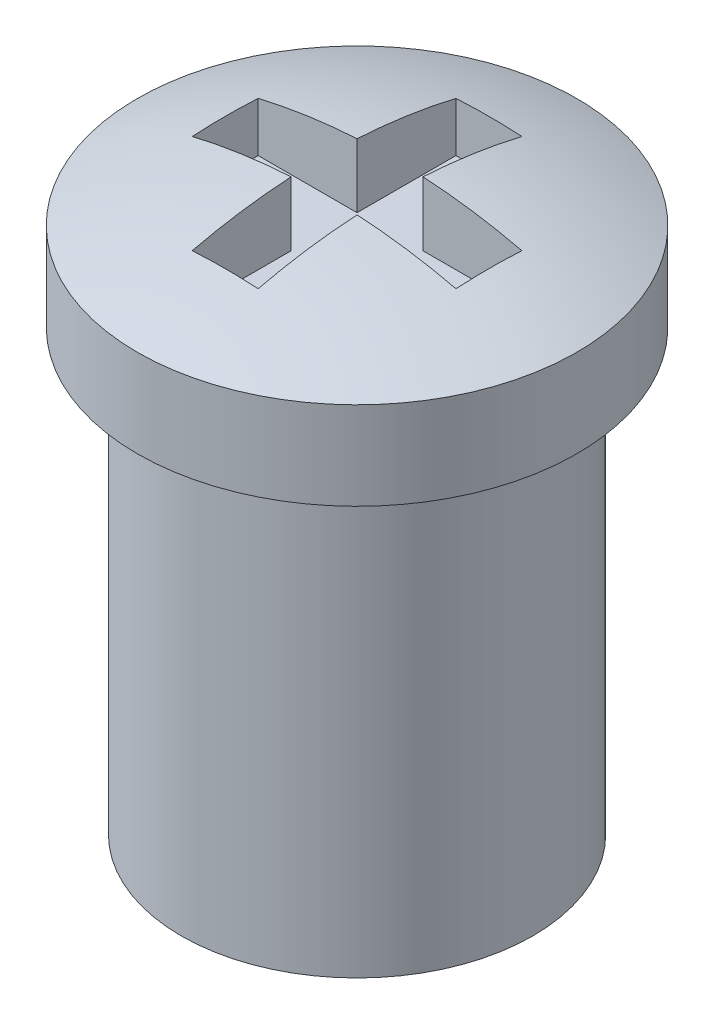
ISO-10303-21;
HEADER;
FILE_DESCRIPTION(('STEP AP214'),'2;1');
FILE_NAME('part.step','',(''),(''),'','','');
FILE_SCHEMA(('AUTOMOTIVE_DESIGN { 1 0 10303 214 1 1 1 1 }'));
ENDSEC;
DATA;
#1=APPLICATION_CONTEXT('core data for automotive mechanical design processes');
#2=APPLICATION_PROTOCOL_DEFINITION('international standard','automotive_design',2000,#1);
#3=PRODUCT_CONTEXT('',#1,'mechanical');
#4=PRODUCT('Part','Part','',(#3));
#5=PRODUCT_RELATED_PRODUCT_CATEGORY('part','',(#4));
#6=PRODUCT_DEFINITION_FORMATION('','',#4);
#7=PRODUCT_DEFINITION_CONTEXT('part definition',#1,'design');
#8=PRODUCT_DEFINITION('design','',#6,#7);
#9=PRODUCT_DEFINITION_SHAPE('','',#8);
#10=(LENGTH_UNIT() NAMED_UNIT(*) SI_UNIT(.MILLI.,.METRE.));
#11=(NAMED_UNIT(*) PLANE_ANGLE_UNIT() SI_UNIT($,.RADIAN.));
#12=(NAMED_UNIT(*) SI_UNIT($,.STERADIAN.) SOLID_ANGLE_UNIT());
#13=UNCERTAINTY_MEASURE_WITH_UNIT(LENGTH_MEASURE(1.E-05),#10,'distance_accuracy_value','');
#14=(GEOMETRIC_REPRESENTATION_CONTEXT(3) GLOBAL_UNCERTAINTY_ASSIGNED_CONTEXT((#13)) GLOBAL_UNIT_ASSIGNED_CONTEXT((#10,
#11,#12)) REPRESENTATION_CONTEXT('',''));
#15=CARTESIAN_POINT('',(0.,0.,0.));
#16=DIRECTION('',(0.,0.,1.));
#17=DIRECTION('',(1.,0.,0.));
#18=AXIS2_PLACEMENT_3D('',#15,#16,#17);
#19=CARTESIAN_POINT('',(0.,5.,0.));
#20=DIRECTION('',(0.,-1.,0.));
#21=DIRECTION('',(0.,0.,-1.));
#22=AXIS2_PLACEMENT_3D('',#19,#20,#21);
#23=CYLINDRICAL_SURFACE('',#22,2.);
#24=CARTESIAN_POINT('',(0.,5.,0.));
#25=DIRECTION('',(0.,1.,0.));
#26=DIRECTION('',(0.,0.,1.));
#27=AXIS2_PLACEMENT_3D('',#24,#25,#26);
#28=CIRCLE('',#27,2.);
#29=CARTESIAN_POINT('',(0.,5.,2.));
#30=VERTEX_POINT('',#29);
#31=EDGE_CURVE('E197',#30,#30,#28,.T.);
#32=ORIENTED_EDGE('',*,*,#31,.F.);
#33=EDGE_LOOP('',(#32));
#34=FACE_BOUND('',#33,.T.);
#35=CARTESIAN_POINT('',(0.,0.,0.));
#36=DIRECTION('',(0.,1.,0.));
#37=DIRECTION('',(0.,0.,1.));
#38=AXIS2_PLACEMENT_3D('',#35,#36,#37);
#39=CIRCLE('',#38,2.);
#40=CARTESIAN_POINT('',(0.,0.,2.));
#41=VERTEX_POINT('',#40);
#42=EDGE_CURVE('E201',#41,#41,#39,.T.);
#43=ORIENTED_EDGE('',*,*,#42,.T.);
#44=EDGE_LOOP('',(#43));
#45=FACE_BOUND('',#44,.T.);
#46=ADVANCED_FACE('F34',(#34,#45),#23,.T.);
#47=CARTESIAN_POINT('',(0.,0.,0.));
#48=DIRECTION('',(0.,1.,0.));
#49=DIRECTION('',(0.,0.,1.));
#50=AXIS2_PLACEMENT_3D('',#47,#48,#49);
#51=PLANE('',#50);
#52=ORIENTED_EDGE('',*,*,#42,.F.);
#53=EDGE_LOOP('',(#52));
#54=FACE_BOUND('',#53,.T.);
#55=ADVANCED_FACE('F275',(#54),#51,.F.);
#56=CARTESIAN_POINT('',(0.,6.,0.));
#57=DIRECTION('',(0.,-1.,0.));
#58=DIRECTION('',(0.,0.,-1.));
#59=AXIS2_PLACEMENT_3D('',#56,#57,#58);
#60=CYLINDRICAL_SURFACE('',#59,2.5);
#61=CARTESIAN_POINT('',(0.,6.,0.));
#62=DIRECTION('',(0.,1.,0.));
#63=DIRECTION('',(0.,0.,1.));
#64=AXIS2_PLACEMENT_3D('',#61,#62,#63);
#65=CIRCLE('',#64,2.5);
#66=CARTESIAN_POINT('',(0.,6.,2.5));
#67=VERTEX_POINT('',#66);
#68=EDGE_CURVE('E196',#67,#67,#65,.T.);
#69=ORIENTED_EDGE('',*,*,#68,.F.);
#70=EDGE_LOOP('',(#69));
#71=FACE_BOUND('',#70,.T.);
#72=CARTESIAN_POINT('',(0.,5.,0.));
#73=DIRECTION('',(0.,1.,0.));
#74=DIRECTION('',(0.,0.,1.));
#75=AXIS2_PLACEMENT_3D('',#72,#73,#74);
#76=CIRCLE('',#75,2.5);
#77=CARTESIAN_POINT('',(0.,5.,2.5));
#78=VERTEX_POINT('',#77);
#79=EDGE_CURVE('E166',#78,#78,#76,.T.);
#80=ORIENTED_EDGE('',*,*,#79,.T.);
#81=EDGE_LOOP('',(#80));
#82=FACE_BOUND('',#81,.T.);
#83=ADVANCED_FACE('F280',(#71,#82),#60,.T.);
#84=CARTESIAN_POINT('',(0.,0.,0.));
#85=DIRECTION('',(0.,0.,1.));
#86=DIRECTION('',(1.,0.,0.));
#87=AXIS2_PLACEMENT_3D('',#84,#85,#86);
#88=SPHERICAL_SURFACE('',#87,6.49999999999999);
#89=CARTESIAN_POINT('',(0.,0.,0.375));
#90=DIRECTION('',(0.,0.,1.));
#91=DIRECTION('',(1.,0.,0.));
#92=AXIS2_PLACEMENT_3D('',#89,#90,#91);
#93=CIRCLE('',#92,6.4891736762087);
#94=CARTESIAN_POINT('',(-1.5,6.3134281495872,0.375));
#95=VERTEX_POINT('',#94);
#96=CARTESIAN_POINT('',(-0.375,6.47832925992497,0.375));
#97=VERTEX_POINT('',#96);
#98=EDGE_CURVE('E11',#95,#97,#93,.F.);
#99=ORIENTED_EDGE('',*,*,#98,.F.);
#100=CARTESIAN_POINT('',(-1.5,0.,0.));
#101=DIRECTION('',(-1.,0.,0.));
#102=DIRECTION('',(0.,0.,1.));
#103=AXIS2_PLACEMENT_3D('',#100,#101,#102);
#104=CIRCLE('',#103,6.32455532033675);
#105=CARTESIAN_POINT('',(-1.5,6.3134281495872,-0.375));
#106=VERTEX_POINT('',#105);
#107=EDGE_CURVE('E42',#106,#95,#104,.F.);
#108=ORIENTED_EDGE('',*,*,#107,.F.);
#109=CARTESIAN_POINT('',(0.,0.,-0.375));
#110=DIRECTION('',(0.,0.,1.));
#111=DIRECTION('',(1.,0.,0.));
#112=AXIS2_PLACEMENT_3D('',#109,#110,#111);
#113=CIRCLE('',#112,6.4891736762087);
#114=CARTESIAN_POINT('',(-0.375,6.47832925992497,-0.375));
#115=VERTEX_POINT('',#114);
#116=EDGE_CURVE('E228',#106,#115,#113,.F.);
#117=ORIENTED_EDGE('',*,*,#116,.T.);
#118=CARTESIAN_POINT('',(-0.375,0.,0.));
#119=DIRECTION('',(-1.,0.,0.));
#120=DIRECTION('',(0.,0.,1.));
#121=AXIS2_PLACEMENT_3D('',#118,#119,#120);
#122=CIRCLE('',#121,6.4891736762087);
#123=CARTESIAN_POINT('',(-0.375,6.3134281495872,-1.5));
#124=VERTEX_POINT('',#123);
#125=EDGE_CURVE('E226',#124,#115,#122,.F.);
#126=ORIENTED_EDGE('',*,*,#125,.F.);
#127=CARTESIAN_POINT('',(0.,0.,-1.5));
#128=DIRECTION('',(0.,0.,1.));
#129=DIRECTION('',(1.,0.,0.));
#130=AXIS2_PLACEMENT_3D('',#127,#128,#129);
#131=CIRCLE('',#130,6.32455532033675);
#132=CARTESIAN_POINT('',(0.375,6.3134281495872,-1.5));
#133=VERTEX_POINT('',#132);
#134=EDGE_CURVE('E223',#124,#133,#131,.F.);
#135=ORIENTED_EDGE('',*,*,#134,.T.);
#136=CARTESIAN_POINT('',(0.375,0.,0.));
#137=DIRECTION('',(-1.,0.,0.));
#138=DIRECTION('',(0.,0.,1.));
#139=AXIS2_PLACEMENT_3D('',#136,#137,#138);
#140=CIRCLE('',#139,6.4891736762087);
#141=CARTESIAN_POINT('',(0.375,6.47832925992497,-0.375));
#142=VERTEX_POINT('',#141);
#143=EDGE_CURVE('E220',#133,#142,#140,.F.);
#144=ORIENTED_EDGE('',*,*,#143,.T.);
#145=CARTESIAN_POINT('',(0.,0.,-0.375));
#146=DIRECTION('',(0.,0.,1.));
#147=DIRECTION('',(1.,0.,0.));
#148=AXIS2_PLACEMENT_3D('',#145,#146,#147);
#149=CIRCLE('',#148,6.4891736762087);
#150=CARTESIAN_POINT('',(1.5,6.3134281495872,-0.375));
#151=VERTEX_POINT('',#150);
#152=EDGE_CURVE('E217',#142,#151,#149,.F.);
#153=ORIENTED_EDGE('',*,*,#152,.T.);
#154=CARTESIAN_POINT('',(1.5,0.,0.));
#155=DIRECTION('',(-1.,0.,0.));
#156=DIRECTION('',(0.,0.,1.));
#157=AXIS2_PLACEMENT_3D('',#154,#155,#156);
#158=CIRCLE('',#157,6.32455532033675);
#159=CARTESIAN_POINT('',(1.5,6.3134281495872,0.375));
#160=VERTEX_POINT('',#159);
#161=EDGE_CURVE('E214',#151,#160,#158,.F.);
#162=ORIENTED_EDGE('',*,*,#161,.T.);
#163=CARTESIAN_POINT('',(0.,0.,0.375));
#164=DIRECTION('',(0.,0.,1.));
#165=DIRECTION('',(1.,0.,0.));
#166=AXIS2_PLACEMENT_3D('',#163,#164,#165);
#167=CIRCLE('',#166,6.4891736762087);
#168=CARTESIAN_POINT('',(0.375,6.47832925992497,0.375));
#169=VERTEX_POINT('',#168);
#170=EDGE_CURVE('E212',#169,#160,#167,.F.);
#171=ORIENTED_EDGE('',*,*,#170,.F.);
#172=CARTESIAN_POINT('',(0.375,0.,0.));
#173=DIRECTION('',(-1.,0.,0.));
#174=DIRECTION('',(0.,0.,1.));
#175=AXIS2_PLACEMENT_3D('',#172,#173,#174);
#176=CIRCLE('',#175,6.4891736762087);
#177=CARTESIAN_POINT('',(0.375,6.3134281495872,1.5));
#178=VERTEX_POINT('',#177);
#179=EDGE_CURVE('E209',#169,#178,#176,.F.);
#180=ORIENTED_EDGE('',*,*,#179,.T.);
#181=CARTESIAN_POINT('',(0.,0.,1.5));
#182=DIRECTION('',(0.,0.,1.));
#183=DIRECTION('',(1.,0.,0.));
#184=AXIS2_PLACEMENT_3D('',#181,#182,#183);
#185=CIRCLE('',#184,6.32455532033675);
#186=CARTESIAN_POINT('',(-0.375,6.3134281495872,1.5));
#187=VERTEX_POINT('',#186);
#188=EDGE_CURVE('E207',#187,#178,#185,.F.);
#189=ORIENTED_EDGE('',*,*,#188,.F.);
#190=CARTESIAN_POINT('',(-0.375,0.,0.));
#191=DIRECTION('',(-1.,0.,0.));
#192=DIRECTION('',(0.,0.,1.));
#193=AXIS2_PLACEMENT_3D('',#190,#191,#192);
#194=CIRCLE('',#193,6.4891736762087);
#195=EDGE_CURVE('E200',#97,#187,#194,.F.);
#196=ORIENTED_EDGE('',*,*,#195,.F.);
#197=EDGE_LOOP('',(#99,#108,#117,#126,#135,#144,#153,#162,#171,#180,#189,#196));
#198=FACE_BOUND('',#197,.T.);
#199=ORIENTED_EDGE('',*,*,#68,.T.);
#200=EDGE_LOOP('',(#199));
#201=FACE_BOUND('',#200,.T.);
#202=ADVANCED_FACE('F36',(#198,#201),#88,.T.);
#203=CARTESIAN_POINT('',(0.,5.,0.));
#204=DIRECTION('',(0.,1.,0.));
#205=DIRECTION('',(0.,0.,1.));
#206=AXIS2_PLACEMENT_3D('',#203,#204,#205);
#207=PLANE('',#206);
#208=ORIENTED_EDGE('',*,*,#31,.T.);
#209=EDGE_LOOP('',(#208));
#210=FACE_BOUND('',#209,.T.);
#211=ORIENTED_EDGE('',*,*,#79,.F.);
#212=EDGE_LOOP('',(#211));
#213=FACE_BOUND('',#212,.T.);
#214=ADVANCED_FACE('F289',(#210,#213),#207,.F.);
#215=CARTESIAN_POINT('',(0.,5.75,0.375));
#216=DIRECTION('',(0.,0.,1.));
#217=DIRECTION('',(1.,0.,0.));
#218=AXIS2_PLACEMENT_3D('',#215,#216,#217);
#219=PLANE('',#218);
#220=ORIENTED_EDGE('',*,*,#98,.T.);
#221=DIRECTION('',(0.,1.,0.));
#222=VECTOR('',#221,1.);
#223=CARTESIAN_POINT('',(-0.375,5.75,0.375));
#224=LINE('',#223,#222);
#225=CARTESIAN_POINT('',(-0.375,5.75,0.375));
#226=VERTEX_POINT('',#225);
#227=EDGE_CURVE('E49',#226,#97,#224,.T.);
#228=ORIENTED_EDGE('',*,*,#227,.F.);
#229=DIRECTION('',(1.,0.,0.));
#230=VECTOR('',#229,1.);
#231=CARTESIAN_POINT('',(0.,5.75,0.375));
#232=LINE('',#231,#230);
#233=CARTESIAN_POINT('',(-1.5,5.75,0.375));
#234=VERTEX_POINT('',#233);
#235=EDGE_CURVE('E123',#234,#226,#232,.T.);
#236=ORIENTED_EDGE('',*,*,#235,.F.);
#237=DIRECTION('',(0.,1.,0.));
#238=VECTOR('',#237,1.);
#239=CARTESIAN_POINT('',(-1.5,5.75,0.375));
#240=LINE('',#239,#238);
#241=EDGE_CURVE('E164',#234,#95,#240,.T.);
#242=ORIENTED_EDGE('',*,*,#241,.T.);
#243=EDGE_LOOP('',(#220,#228,#236,#242));
#244=FACE_BOUND('',#243,.T.);
#245=ADVANCED_FACE('F121',(#244),#219,.F.);
#246=CARTESIAN_POINT('',(-1.5,5.75,0.));
#247=DIRECTION('',(-1.,0.,0.));
#248=DIRECTION('',(0.,0.,1.));
#249=AXIS2_PLACEMENT_3D('',#246,#247,#248);
#250=PLANE('',#249);
#251=ORIENTED_EDGE('',*,*,#107,.T.);
#252=ORIENTED_EDGE('',*,*,#241,.F.);
#253=DIRECTION('',(0.,0.,1.));
#254=VECTOR('',#253,1.);
#255=CARTESIAN_POINT('',(-1.5,5.75,0.));
#256=LINE('',#255,#254);
#257=CARTESIAN_POINT('',(-1.5,5.75,-0.375));
#258=VERTEX_POINT('',#257);
#259=EDGE_CURVE('E128',#258,#234,#256,.T.);
#260=ORIENTED_EDGE('',*,*,#259,.F.);
#261=DIRECTION('',(0.,1.,0.));
#262=VECTOR('',#261,1.);
#263=CARTESIAN_POINT('',(-1.5,5.75,-0.375));
#264=LINE('',#263,#262);
#265=EDGE_CURVE('E167',#258,#106,#264,.T.);
#266=ORIENTED_EDGE('',*,*,#265,.T.);
#267=EDGE_LOOP('',(#251,#252,#260,#266));
#268=FACE_BOUND('',#267,.T.);
#269=ADVANCED_FACE('F236',(#268),#250,.F.);
#270=CARTESIAN_POINT('',(0.,5.75,-0.375));
#271=DIRECTION('',(0.,0.,1.));
#272=DIRECTION('',(1.,0.,0.));
#273=AXIS2_PLACEMENT_3D('',#270,#271,#272);
#274=PLANE('',#273);
#275=ORIENTED_EDGE('',*,*,#265,.F.);
#276=DIRECTION('',(1.,0.,0.));
#277=VECTOR('',#276,1.);
#278=CARTESIAN_POINT('',(0.,5.75,-0.375));
#279=LINE('',#278,#277);
#280=CARTESIAN_POINT('',(-0.375,5.75,-0.375));
#281=VERTEX_POINT('',#280);
#282=EDGE_CURVE('E161',#258,#281,#279,.T.);
#283=ORIENTED_EDGE('',*,*,#282,.T.);
#284=DIRECTION('',(0.,1.,0.));
#285=VECTOR('',#284,1.);
#286=CARTESIAN_POINT('',(-0.375,5.75,-0.375));
#287=LINE('',#286,#285);
#288=EDGE_CURVE('E169',#281,#115,#287,.T.);
#289=ORIENTED_EDGE('',*,*,#288,.T.);
#290=ORIENTED_EDGE('',*,*,#116,.F.);
#291=EDGE_LOOP('',(#275,#283,#289,#290));
#292=FACE_BOUND('',#291,.T.);
#293=ADVANCED_FACE('F234',(#292),#274,.T.);
#294=CARTESIAN_POINT('',(-0.375,5.75,0.));
#295=DIRECTION('',(-1.,0.,0.));
#296=DIRECTION('',(0.,0.,1.));
#297=AXIS2_PLACEMENT_3D('',#294,#295,#296);
#298=PLANE('',#297);
#299=ORIENTED_EDGE('',*,*,#125,.T.);
#300=ORIENTED_EDGE('',*,*,#288,.F.);
#301=DIRECTION('',(0.,0.,1.));
#302=VECTOR('',#301,1.);
#303=CARTESIAN_POINT('',(-0.375,5.75,0.));
#304=LINE('',#303,#302);
#305=CARTESIAN_POINT('',(-0.375,5.75,-1.5));
#306=VERTEX_POINT('',#305);
#307=EDGE_CURVE('E158',#306,#281,#304,.T.);
#308=ORIENTED_EDGE('',*,*,#307,.F.);
#309=DIRECTION('',(0.,1.,0.));
#310=VECTOR('',#309,1.);
#311=CARTESIAN_POINT('',(-0.375,5.75,-1.5));
#312=LINE('',#311,#310);
#313=EDGE_CURVE('E172',#306,#124,#312,.T.);
#314=ORIENTED_EDGE('',*,*,#313,.T.);
#315=EDGE_LOOP('',(#299,#300,#308,#314));
#316=FACE_BOUND('',#315,.T.);
#317=ADVANCED_FACE('F264',(#316),#298,.F.);
#318=CARTESIAN_POINT('',(0.,5.75,-1.5));
#319=DIRECTION('',(0.,0.,1.));
#320=DIRECTION('',(1.,0.,0.));
#321=AXIS2_PLACEMENT_3D('',#318,#319,#320);
#322=PLANE('',#321);
#323=ORIENTED_EDGE('',*,*,#313,.F.);
#324=DIRECTION('',(1.,0.,0.));
#325=VECTOR('',#324,1.);
#326=CARTESIAN_POINT('',(0.,5.75,-1.5));
#327=LINE('',#326,#325);
#328=CARTESIAN_POINT('',(0.375,5.75,-1.5));
#329=VERTEX_POINT('',#328);
#330=EDGE_CURVE('E156',#306,#329,#327,.T.);
#331=ORIENTED_EDGE('',*,*,#330,.T.);
#332=DIRECTION('',(0.,1.,0.));
#333=VECTOR('',#332,1.);
#334=CARTESIAN_POINT('',(0.375,5.75,-1.5));
#335=LINE('',#334,#333);
#336=EDGE_CURVE('E175',#329,#133,#335,.T.);
#337=ORIENTED_EDGE('',*,*,#336,.T.);
#338=ORIENTED_EDGE('',*,*,#134,.F.);
#339=EDGE_LOOP('',(#323,#331,#337,#338));
#340=FACE_BOUND('',#339,.T.);
#341=ADVANCED_FACE('F265',(#340),#322,.T.);
#342=CARTESIAN_POINT('',(0.375,5.75,0.));
#343=DIRECTION('',(-1.,0.,0.));
#344=DIRECTION('',(0.,0.,1.));
#345=AXIS2_PLACEMENT_3D('',#342,#343,#344);
#346=PLANE('',#345);
#347=ORIENTED_EDGE('',*,*,#336,.F.);
#348=DIRECTION('',(0.,0.,1.));
#349=VECTOR('',#348,1.);
#350=CARTESIAN_POINT('',(0.375,5.75,0.));
#351=LINE('',#350,#349);
#352=CARTESIAN_POINT('',(0.375,5.75,-0.375));
#353=VERTEX_POINT('',#352);
#354=EDGE_CURVE('E154',#329,#353,#351,.T.);
#355=ORIENTED_EDGE('',*,*,#354,.T.);
#356=DIRECTION('',(0.,1.,0.));
#357=VECTOR('',#356,1.);
#358=CARTESIAN_POINT('',(0.375,5.75,-0.375));
#359=LINE('',#358,#357);
#360=EDGE_CURVE('E178',#353,#142,#359,.T.);
#361=ORIENTED_EDGE('',*,*,#360,.T.);
#362=ORIENTED_EDGE('',*,*,#143,.F.);
#363=EDGE_LOOP('',(#347,#355,#361,#362));
#364=FACE_BOUND('',#363,.T.);
#365=ADVANCED_FACE('F258',(#364),#346,.T.);
#366=CARTESIAN_POINT('',(0.,5.75,-0.375));
#367=DIRECTION('',(0.,0.,1.));
#368=DIRECTION('',(1.,0.,0.));
#369=AXIS2_PLACEMENT_3D('',#366,#367,#368);
#370=PLANE('',#369);
#371=ORIENTED_EDGE('',*,*,#360,.F.);
#372=DIRECTION('',(1.,0.,0.));
#373=VECTOR('',#372,1.);
#374=CARTESIAN_POINT('',(0.,5.75,-0.375));
#375=LINE('',#374,#373);
#376=CARTESIAN_POINT('',(1.5,5.75,-0.375));
#377=VERTEX_POINT('',#376);
#378=EDGE_CURVE('E152',#353,#377,#375,.T.);
#379=ORIENTED_EDGE('',*,*,#378,.T.);
#380=DIRECTION('',(0.,1.,0.));
#381=VECTOR('',#380,1.);
#382=CARTESIAN_POINT('',(1.5,5.75,-0.375));
#383=LINE('',#382,#381);
#384=EDGE_CURVE('E181',#377,#151,#383,.T.);
#385=ORIENTED_EDGE('',*,*,#384,.T.);
#386=ORIENTED_EDGE('',*,*,#152,.F.);
#387=EDGE_LOOP('',(#371,#379,#385,#386));
#388=FACE_BOUND('',#387,.T.);
#389=ADVANCED_FACE('F254',(#388),#370,.T.);
#390=CARTESIAN_POINT('',(1.5,5.75,0.));
#391=DIRECTION('',(-1.,0.,0.));
#392=DIRECTION('',(0.,0.,1.));
#393=AXIS2_PLACEMENT_3D('',#390,#391,#392);
#394=PLANE('',#393);
#395=ORIENTED_EDGE('',*,*,#384,.F.);
#396=DIRECTION('',(0.,0.,1.));
#397=VECTOR('',#396,1.);
#398=CARTESIAN_POINT('',(1.5,5.75,0.));
#399=LINE('',#398,#397);
#400=CARTESIAN_POINT('',(1.5,5.75,0.375));
#401=VERTEX_POINT('',#400);
#402=EDGE_CURVE('E150',#377,#401,#399,.T.);
#403=ORIENTED_EDGE('',*,*,#402,.T.);
#404=DIRECTION('',(0.,1.,0.));
#405=VECTOR('',#404,1.);
#406=CARTESIAN_POINT('',(1.5,5.75,0.375));
#407=LINE('',#406,#405);
#408=EDGE_CURVE('E184',#401,#160,#407,.T.);
#409=ORIENTED_EDGE('',*,*,#408,.T.);
#410=ORIENTED_EDGE('',*,*,#161,.F.);
#411=EDGE_LOOP('',(#395,#403,#409,#410));
#412=FACE_BOUND('',#411,.T.);
#413=ADVANCED_FACE('F251',(#412),#394,.T.);
#414=CARTESIAN_POINT('',(0.,5.75,0.375));
#415=DIRECTION('',(0.,0.,1.));
#416=DIRECTION('',(1.,0.,0.));
#417=AXIS2_PLACEMENT_3D('',#414,#415,#416);
#418=PLANE('',#417);
#419=ORIENTED_EDGE('',*,*,#170,.T.);
#420=ORIENTED_EDGE('',*,*,#408,.F.);
#421=DIRECTION('',(1.,0.,0.));
#422=VECTOR('',#421,1.);
#423=CARTESIAN_POINT('',(0.,5.75,0.375));
#424=LINE('',#423,#422);
#425=CARTESIAN_POINT('',(0.375,5.75,0.375));
#426=VERTEX_POINT('',#425);
#427=EDGE_CURVE('E147',#426,#401,#424,.T.);
#428=ORIENTED_EDGE('',*,*,#427,.F.);
#429=DIRECTION('',(0.,1.,0.));
#430=VECTOR('',#429,1.);
#431=CARTESIAN_POINT('',(0.375,5.75,0.375));
#432=LINE('',#431,#430);
#433=EDGE_CURVE('E187',#426,#169,#432,.T.);
#434=ORIENTED_EDGE('',*,*,#433,.T.);
#435=EDGE_LOOP('',(#419,#420,#428,#434));
#436=FACE_BOUND('',#435,.T.);
#437=ADVANCED_FACE('F247',(#436),#418,.F.);
#438=CARTESIAN_POINT('',(0.375,5.75,0.));
#439=DIRECTION('',(-1.,0.,0.));
#440=DIRECTION('',(0.,0.,1.));
#441=AXIS2_PLACEMENT_3D('',#438,#439,#440);
#442=PLANE('',#441);
#443=ORIENTED_EDGE('',*,*,#433,.F.);
#444=DIRECTION('',(0.,0.,1.));
#445=VECTOR('',#444,1.);
#446=CARTESIAN_POINT('',(0.375,5.75,0.));
#447=LINE('',#446,#445);
#448=CARTESIAN_POINT('',(0.375,5.75,1.5));
#449=VERTEX_POINT('',#448);
#450=EDGE_CURVE('E145',#426,#449,#447,.T.);
#451=ORIENTED_EDGE('',*,*,#450,.T.);
#452=DIRECTION('',(0.,1.,0.));
#453=VECTOR('',#452,1.);
#454=CARTESIAN_POINT('',(0.375,5.75,1.5));
#455=LINE('',#454,#453);
#456=EDGE_CURVE('E190',#449,#178,#455,.T.);
#457=ORIENTED_EDGE('',*,*,#456,.T.);
#458=ORIENTED_EDGE('',*,*,#179,.F.);
#459=EDGE_LOOP('',(#443,#451,#457,#458));
#460=FACE_BOUND('',#459,.T.);
#461=ADVANCED_FACE('F299',(#460),#442,.T.);
#462=CARTESIAN_POINT('',(0.,5.75,1.5));
#463=DIRECTION('',(0.,0.,1.));
#464=DIRECTION('',(1.,0.,0.));
#465=AXIS2_PLACEMENT_3D('',#462,#463,#464);
#466=PLANE('',#465);
#467=ORIENTED_EDGE('',*,*,#188,.T.);
#468=ORIENTED_EDGE('',*,*,#456,.F.);
#469=DIRECTION('',(1.,0.,0.));
#470=VECTOR('',#469,1.);
#471=CARTESIAN_POINT('',(0.,5.75,1.5));
#472=LINE('',#471,#470);
#473=CARTESIAN_POINT('',(-0.375,5.75,1.5));
#474=VERTEX_POINT('',#473);
#475=EDGE_CURVE('E137',#474,#449,#472,.T.);
#476=ORIENTED_EDGE('',*,*,#475,.F.);
#477=DIRECTION('',(0.,1.,0.));
#478=VECTOR('',#477,1.);
#479=CARTESIAN_POINT('',(-0.375,5.75,1.5));
#480=LINE('',#479,#478);
#481=EDGE_CURVE('E127',#474,#187,#480,.T.);
#482=ORIENTED_EDGE('',*,*,#481,.T.);
#483=EDGE_LOOP('',(#467,#468,#476,#482));
#484=FACE_BOUND('',#483,.T.);
#485=ADVANCED_FACE('F239',(#484),#466,.F.);
#486=CARTESIAN_POINT('',(-0.375,5.75,0.));
#487=DIRECTION('',(-1.,0.,0.));
#488=DIRECTION('',(0.,0.,1.));
#489=AXIS2_PLACEMENT_3D('',#486,#487,#488);
#490=PLANE('',#489);
#491=ORIENTED_EDGE('',*,*,#195,.T.);
#492=ORIENTED_EDGE('',*,*,#481,.F.);
#493=DIRECTION('',(0.,0.,1.));
#494=VECTOR('',#493,1.);
#495=CARTESIAN_POINT('',(-0.375,5.75,0.));
#496=LINE('',#495,#494);
#497=EDGE_CURVE('E131',#226,#474,#496,.T.);
#498=ORIENTED_EDGE('',*,*,#497,.F.);
#499=ORIENTED_EDGE('',*,*,#227,.T.);
#500=EDGE_LOOP('',(#491,#492,#498,#499));
#501=FACE_BOUND('',#500,.T.);
#502=ADVANCED_FACE('F132',(#501),#490,.F.);
#503=CARTESIAN_POINT('',(0.,5.75,0.));
#504=DIRECTION('',(0.,1.,0.));
#505=DIRECTION('',(0.,0.,1.));
#506=AXIS2_PLACEMENT_3D('',#503,#504,#505);
#507=PLANE('',#506);
#508=ORIENTED_EDGE('',*,*,#235,.T.);
#509=ORIENTED_EDGE('',*,*,#497,.T.);
#510=ORIENTED_EDGE('',*,*,#475,.T.);
#511=ORIENTED_EDGE('',*,*,#450,.F.);
#512=ORIENTED_EDGE('',*,*,#427,.T.);
#513=ORIENTED_EDGE('',*,*,#402,.F.);
#514=ORIENTED_EDGE('',*,*,#378,.F.);
#515=ORIENTED_EDGE('',*,*,#354,.F.);
#516=ORIENTED_EDGE('',*,*,#330,.F.);
#517=ORIENTED_EDGE('',*,*,#307,.T.);
#518=ORIENTED_EDGE('',*,*,#282,.F.);
#519=ORIENTED_EDGE('',*,*,#259,.T.);
#520=EDGE_LOOP('',(#508,#509,#510,#511,#512,#513,#514,#515,#516,#517,#518,#519));
#521=FACE_BOUND('',#520,.T.);
#522=ADVANCED_FACE('F139',(#521),#507,.T.);
#523=CLOSED_SHELL('',(#46,#55,#83,#202,#214,#245,#269,#293,#317,#341,#365,#389,#413,#437,#461,
#485,#502,#522));
#524=MANIFOLD_SOLID_BREP('B2',#523);
#525=ADVANCED_BREP_SHAPE_REPRESENTATION('',(#18,#524),#14);
#526=SHAPE_DEFINITION_REPRESENTATION(#9,#525);
ENDSEC;
END-ISO-10303-21;
